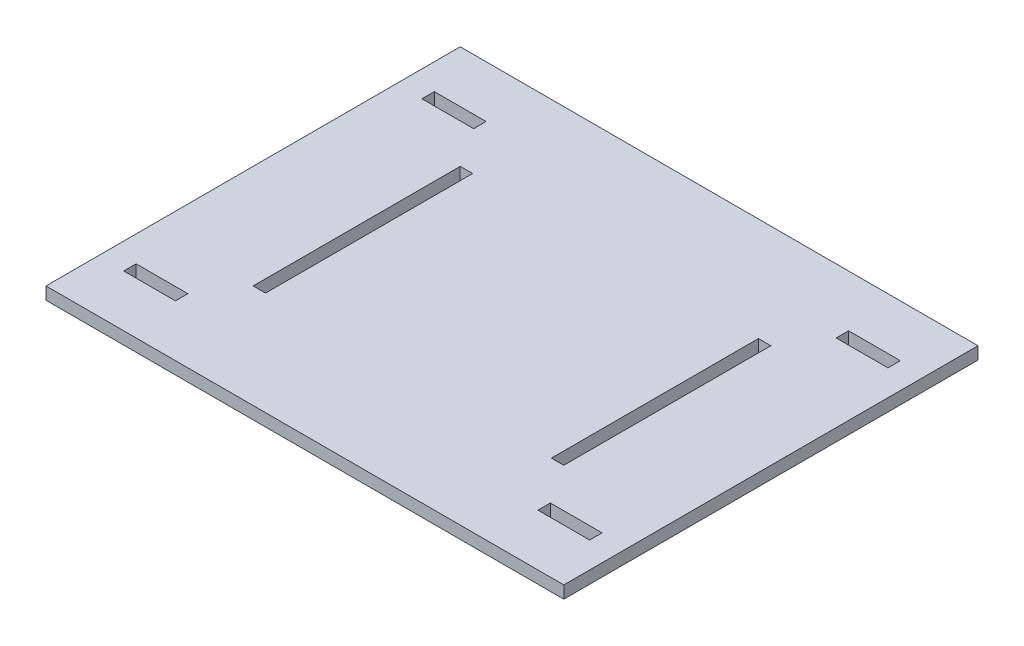
ISO-10303-21;
HEADER;
FILE_DESCRIPTION(('STEP AP214'),'2;1');
FILE_NAME('part.step','',(''),(''),'','','');
FILE_SCHEMA(('AUTOMOTIVE_DESIGN { 1 0 10303 214 1 1 1 1 }'));
ENDSEC;
DATA;
#1=APPLICATION_CONTEXT('core data for automotive mechanical design processes');
#2=APPLICATION_PROTOCOL_DEFINITION('international standard','automotive_design',2000,#1);
#3=PRODUCT_CONTEXT('',#1,'mechanical');
#4=PRODUCT('Part','Part','',(#3));
#5=PRODUCT_RELATED_PRODUCT_CATEGORY('part','',(#4));
#6=PRODUCT_DEFINITION_FORMATION('','',#4);
#7=PRODUCT_DEFINITION_CONTEXT('part definition',#1,'design');
#8=PRODUCT_DEFINITION('design','',#6,#7);
#9=PRODUCT_DEFINITION_SHAPE('','',#8);
#10=(LENGTH_UNIT() NAMED_UNIT(*) SI_UNIT(.MILLI.,.METRE.));
#11=(NAMED_UNIT(*) PLANE_ANGLE_UNIT() SI_UNIT($,.RADIAN.));
#12=(NAMED_UNIT(*) SI_UNIT($,.STERADIAN.) SOLID_ANGLE_UNIT());
#13=UNCERTAINTY_MEASURE_WITH_UNIT(LENGTH_MEASURE(1.E-05),#10,'distance_accuracy_value','');
#14=(GEOMETRIC_REPRESENTATION_CONTEXT(3) GLOBAL_UNCERTAINTY_ASSIGNED_CONTEXT((#13)) GLOBAL_UNIT_ASSIGNED_CONTEXT((#10,
#11,#12)) REPRESENTATION_CONTEXT('',''));
#15=CARTESIAN_POINT('',(0.,0.,0.));
#16=DIRECTION('',(0.,0.,1.));
#17=DIRECTION('',(1.,0.,0.));
#18=AXIS2_PLACEMENT_3D('',#15,#16,#17);
#19=CARTESIAN_POINT('',(-250.,12.,-200.));
#20=DIRECTION('',(0.,0.,-1.));
#21=DIRECTION('',(-1.,0.,0.));
#22=AXIS2_PLACEMENT_3D('',#19,#20,#21);
#23=PLANE('',#22);
#24=DIRECTION('',(1.,0.,0.));
#25=VECTOR('',#24,1.);
#26=CARTESIAN_POINT('',(-250.,0.,-200.));
#27=LINE('',#26,#25);
#28=CARTESIAN_POINT('',(-250.,0.,-200.));
#29=VERTEX_POINT('',#28);
#30=CARTESIAN_POINT('',(250.,0.,-200.));
#31=VERTEX_POINT('',#30);
#32=EDGE_CURVE('E458',#29,#31,#27,.T.);
#33=ORIENTED_EDGE('',*,*,#32,.F.);
#34=DIRECTION('',(0.,-1.,0.));
#35=VECTOR('',#34,1.);
#36=CARTESIAN_POINT('',(-250.,12.,-200.));
#37=LINE('',#36,#35);
#38=CARTESIAN_POINT('',(-250.,12.,-200.));
#39=VERTEX_POINT('',#38);
#40=EDGE_CURVE('E11',#39,#29,#37,.T.);
#41=ORIENTED_EDGE('',*,*,#40,.F.);
#42=DIRECTION('',(1.,0.,0.));
#43=VECTOR('',#42,1.);
#44=CARTESIAN_POINT('',(-250.,12.,-200.));
#45=LINE('',#44,#43);
#46=CARTESIAN_POINT('',(250.,12.,-200.));
#47=VERTEX_POINT('',#46);
#48=EDGE_CURVE('E481',#39,#47,#45,.T.);
#49=ORIENTED_EDGE('',*,*,#48,.T.);
#50=DIRECTION('',(0.,-1.,0.));
#51=VECTOR('',#50,1.);
#52=CARTESIAN_POINT('',(250.,12.,-200.));
#53=LINE('',#52,#51);
#54=EDGE_CURVE('E45',#47,#31,#53,.T.);
#55=ORIENTED_EDGE('',*,*,#54,.T.);
#56=EDGE_LOOP('',(#33,#41,#49,#55));
#57=FACE_BOUND('',#56,.T.);
#58=ADVANCED_FACE('F42',(#57),#23,.T.);
#59=CARTESIAN_POINT('',(-250.,12.,-200.));
#60=DIRECTION('',(1.,0.,0.));
#61=DIRECTION('',(0.,0.,-1.));
#62=AXIS2_PLACEMENT_3D('',#59,#60,#61);
#63=PLANE('',#62);
#64=DIRECTION('',(0.,0.,1.));
#65=VECTOR('',#64,1.);
#66=CARTESIAN_POINT('',(-250.,0.,-200.));
#67=LINE('',#66,#65);
#68=CARTESIAN_POINT('',(-250.,0.,200.));
#69=VERTEX_POINT('',#68);
#70=EDGE_CURVE('E486',#29,#69,#67,.T.);
#71=ORIENTED_EDGE('',*,*,#70,.T.);
#72=DIRECTION('',(0.,-1.,0.));
#73=VECTOR('',#72,1.);
#74=CARTESIAN_POINT('',(-250.,12.,200.));
#75=LINE('',#74,#73);
#76=CARTESIAN_POINT('',(-250.,12.,200.));
#77=VERTEX_POINT('',#76);
#78=EDGE_CURVE('E51',#77,#69,#75,.T.);
#79=ORIENTED_EDGE('',*,*,#78,.F.);
#80=DIRECTION('',(0.,0.,1.));
#81=VECTOR('',#80,1.);
#82=CARTESIAN_POINT('',(-250.,12.,-200.));
#83=LINE('',#82,#81);
#84=EDGE_CURVE('E493',#39,#77,#83,.T.);
#85=ORIENTED_EDGE('',*,*,#84,.F.);
#86=ORIENTED_EDGE('',*,*,#40,.T.);
#87=EDGE_LOOP('',(#71,#79,#85,#86));
#88=FACE_BOUND('',#87,.T.);
#89=ADVANCED_FACE('F528',(#88),#63,.F.);
#90=CARTESIAN_POINT('',(-250.,12.,200.));
#91=DIRECTION('',(0.,0.,-1.));
#92=DIRECTION('',(-1.,0.,0.));
#93=AXIS2_PLACEMENT_3D('',#90,#91,#92);
#94=PLANE('',#93);
#95=DIRECTION('',(1.,0.,0.));
#96=VECTOR('',#95,1.);
#97=CARTESIAN_POINT('',(-250.,0.,200.));
#98=LINE('',#97,#96);
#99=CARTESIAN_POINT('',(250.,0.,200.));
#100=VERTEX_POINT('',#99);
#101=EDGE_CURVE('E503',#69,#100,#98,.T.);
#102=ORIENTED_EDGE('',*,*,#101,.T.);
#103=DIRECTION('',(0.,-1.,0.));
#104=VECTOR('',#103,1.);
#105=CARTESIAN_POINT('',(250.,12.,200.));
#106=LINE('',#105,#104);
#107=CARTESIAN_POINT('',(250.,12.,200.));
#108=VERTEX_POINT('',#107);
#109=EDGE_CURVE('E511',#108,#100,#106,.T.);
#110=ORIENTED_EDGE('',*,*,#109,.F.);
#111=DIRECTION('',(1.,0.,0.));
#112=VECTOR('',#111,1.);
#113=CARTESIAN_POINT('',(-250.,12.,200.));
#114=LINE('',#113,#112);
#115=EDGE_CURVE('E490',#77,#108,#114,.T.);
#116=ORIENTED_EDGE('',*,*,#115,.F.);
#117=ORIENTED_EDGE('',*,*,#78,.T.);
#118=EDGE_LOOP('',(#102,#110,#116,#117));
#119=FACE_BOUND('',#118,.T.);
#120=ADVANCED_FACE('F532',(#119),#94,.F.);
#121=CARTESIAN_POINT('',(250.,12.,-200.));
#122=DIRECTION('',(1.,0.,0.));
#123=DIRECTION('',(0.,0.,-1.));
#124=AXIS2_PLACEMENT_3D('',#121,#122,#123);
#125=PLANE('',#124);
#126=DIRECTION('',(0.,0.,1.));
#127=VECTOR('',#126,1.);
#128=CARTESIAN_POINT('',(250.,0.,-200.));
#129=LINE('',#128,#127);
#130=EDGE_CURVE('E499',#31,#100,#129,.T.);
#131=ORIENTED_EDGE('',*,*,#130,.F.);
#132=ORIENTED_EDGE('',*,*,#54,.F.);
#133=DIRECTION('',(0.,0.,1.));
#134=VECTOR('',#133,1.);
#135=CARTESIAN_POINT('',(250.,12.,-200.));
#136=LINE('',#135,#134);
#137=EDGE_CURVE('E485',#47,#108,#136,.T.);
#138=ORIENTED_EDGE('',*,*,#137,.T.);
#139=ORIENTED_EDGE('',*,*,#109,.T.);
#140=EDGE_LOOP('',(#131,#132,#138,#139));
#141=FACE_BOUND('',#140,.T.);
#142=ADVANCED_FACE('F521',(#141),#125,.T.);
#143=CARTESIAN_POINT('',(0.,12.,0.));
#144=DIRECTION('',(0.,-1.,0.));
#145=DIRECTION('',(0.,0.,-1.));
#146=AXIS2_PLACEMENT_3D('',#143,#144,#145);
#147=PLANE('',#146);
#148=DIRECTION('',(0.,0.,-1.));
#149=VECTOR('',#148,1.);
#150=CARTESIAN_POINT('',(225.,12.,150.));
#151=LINE('',#150,#149);
#152=CARTESIAN_POINT('',(225.,12.,150.));
#153=VERTEX_POINT('',#152);
#154=CARTESIAN_POINT('',(225.,12.,138.));
#155=VERTEX_POINT('',#154);
#156=EDGE_CURVE('E249',#153,#155,#151,.T.);
#157=ORIENTED_EDGE('',*,*,#156,.F.);
#158=DIRECTION('',(1.,0.,0.));
#159=VECTOR('',#158,1.);
#160=CARTESIAN_POINT('',(225.,12.,150.));
#161=LINE('',#160,#159);
#162=CARTESIAN_POINT('',(175.,12.,150.));
#163=VERTEX_POINT('',#162);
#164=EDGE_CURVE('E241',#163,#153,#161,.T.);
#165=ORIENTED_EDGE('',*,*,#164,.F.);
#166=DIRECTION('',(0.,0.,1.));
#167=VECTOR('',#166,1.);
#168=CARTESIAN_POINT('',(175.,12.,150.));
#169=LINE('',#168,#167);
#170=CARTESIAN_POINT('',(175.,12.,138.));
#171=VERTEX_POINT('',#170);
#172=EDGE_CURVE('E229',#171,#163,#169,.T.);
#173=ORIENTED_EDGE('',*,*,#172,.F.);
#174=DIRECTION('',(-1.,0.,0.));
#175=VECTOR('',#174,1.);
#176=CARTESIAN_POINT('',(225.,12.,138.));
#177=LINE('',#176,#175);
#178=EDGE_CURVE('E59',#155,#171,#177,.T.);
#179=ORIENTED_EDGE('',*,*,#178,.F.);
#180=EDGE_LOOP('',(#157,#165,#173,#179));
#181=FACE_BOUND('',#180,.T.);
#182=DIRECTION('',(0.,0.,1.));
#183=VECTOR('',#182,1.);
#184=CARTESIAN_POINT('',(-175.,12.,150.));
#185=LINE('',#184,#183);
#186=CARTESIAN_POINT('',(-175.,12.,138.));
#187=VERTEX_POINT('',#186);
#188=CARTESIAN_POINT('',(-175.,12.,150.));
#189=VERTEX_POINT('',#188);
#190=EDGE_CURVE('E255',#187,#189,#185,.T.);
#191=ORIENTED_EDGE('',*,*,#190,.T.);
#192=DIRECTION('',(-1.,0.,0.));
#193=VECTOR('',#192,1.);
#194=CARTESIAN_POINT('',(-225.,12.,150.));
#195=LINE('',#194,#193);
#196=CARTESIAN_POINT('',(-225.,12.,150.));
#197=VERTEX_POINT('',#196);
#198=EDGE_CURVE('E296',#189,#197,#195,.T.);
#199=ORIENTED_EDGE('',*,*,#198,.T.);
#200=DIRECTION('',(0.,0.,-1.));
#201=VECTOR('',#200,1.);
#202=CARTESIAN_POINT('',(-225.,12.,150.));
#203=LINE('',#202,#201);
#204=CARTESIAN_POINT('',(-225.,12.,138.));
#205=VERTEX_POINT('',#204);
#206=EDGE_CURVE('E288',#197,#205,#203,.T.);
#207=ORIENTED_EDGE('',*,*,#206,.T.);
#208=DIRECTION('',(1.,0.,0.));
#209=VECTOR('',#208,1.);
#210=CARTESIAN_POINT('',(-225.,12.,138.));
#211=LINE('',#210,#209);
#212=EDGE_CURVE('E278',#205,#187,#211,.T.);
#213=ORIENTED_EDGE('',*,*,#212,.T.);
#214=EDGE_LOOP('',(#191,#199,#207,#213));
#215=FACE_BOUND('',#214,.T.);
#216=DIRECTION('',(0.,0.,-1.));
#217=VECTOR('',#216,1.);
#218=CARTESIAN_POINT('',(175.,12.,-150.));
#219=LINE('',#218,#217);
#220=CARTESIAN_POINT('',(175.,12.,-138.));
#221=VERTEX_POINT('',#220);
#222=CARTESIAN_POINT('',(175.,12.,-150.));
#223=VERTEX_POINT('',#222);
#224=EDGE_CURVE('E304',#221,#223,#219,.T.);
#225=ORIENTED_EDGE('',*,*,#224,.T.);
#226=DIRECTION('',(1.,0.,0.));
#227=VECTOR('',#226,1.);
#228=CARTESIAN_POINT('',(225.,12.,-150.));
#229=LINE('',#228,#227);
#230=CARTESIAN_POINT('',(225.,12.,-150.));
#231=VERTEX_POINT('',#230);
#232=EDGE_CURVE('E340',#223,#231,#229,.T.);
#233=ORIENTED_EDGE('',*,*,#232,.T.);
#234=DIRECTION('',(0.,0.,1.));
#235=VECTOR('',#234,1.);
#236=CARTESIAN_POINT('',(225.,12.,-150.));
#237=LINE('',#236,#235);
#238=CARTESIAN_POINT('',(225.,12.,-138.));
#239=VERTEX_POINT('',#238);
#240=EDGE_CURVE('E332',#231,#239,#237,.T.);
#241=ORIENTED_EDGE('',*,*,#240,.T.);
#242=DIRECTION('',(-1.,0.,0.));
#243=VECTOR('',#242,1.);
#244=CARTESIAN_POINT('',(225.,12.,-138.));
#245=LINE('',#244,#243);
#246=EDGE_CURVE('E322',#239,#221,#245,.T.);
#247=ORIENTED_EDGE('',*,*,#246,.T.);
#248=EDGE_LOOP('',(#225,#233,#241,#247));
#249=FACE_BOUND('',#248,.T.);
#250=DIRECTION('',(0.,0.,1.));
#251=VECTOR('',#250,1.);
#252=CARTESIAN_POINT('',(-225.,12.,-150.));
#253=LINE('',#252,#251);
#254=CARTESIAN_POINT('',(-225.,12.,-150.));
#255=VERTEX_POINT('',#254);
#256=CARTESIAN_POINT('',(-225.,12.,-138.));
#257=VERTEX_POINT('',#256);
#258=EDGE_CURVE('E353',#255,#257,#253,.T.);
#259=ORIENTED_EDGE('',*,*,#258,.F.);
#260=DIRECTION('',(-1.,0.,0.));
#261=VECTOR('',#260,1.);
#262=CARTESIAN_POINT('',(-225.,12.,-150.));
#263=LINE('',#262,#261);
#264=CARTESIAN_POINT('',(-175.,12.,-150.));
#265=VERTEX_POINT('',#264);
#266=EDGE_CURVE('E357',#265,#255,#263,.T.);
#267=ORIENTED_EDGE('',*,*,#266,.F.);
#268=DIRECTION('',(0.,0.,-1.));
#269=VECTOR('',#268,1.);
#270=CARTESIAN_POINT('',(-175.,12.,-150.));
#271=LINE('',#270,#269);
#272=CARTESIAN_POINT('',(-175.,12.,-138.));
#273=VERTEX_POINT('',#272);
#274=EDGE_CURVE('E348',#273,#265,#271,.T.);
#275=ORIENTED_EDGE('',*,*,#274,.F.);
#276=DIRECTION('',(1.,0.,0.));
#277=VECTOR('',#276,1.);
#278=CARTESIAN_POINT('',(-225.,12.,-138.));
#279=LINE('',#278,#277);
#280=EDGE_CURVE('E349',#257,#273,#279,.T.);
#281=ORIENTED_EDGE('',*,*,#280,.F.);
#282=EDGE_LOOP('',(#259,#267,#275,#281));
#283=FACE_BOUND('',#282,.T.);
#284=DIRECTION('',(-1.,0.,0.));
#285=VECTOR('',#284,1.);
#286=CARTESIAN_POINT('',(150.,12.,-99.9999999999998));
#287=LINE('',#286,#285);
#288=CARTESIAN_POINT('',(150.,12.,-99.9999999999998));
#289=VERTEX_POINT('',#288);
#290=CARTESIAN_POINT('',(138.,12.,-99.9999999999998));
#291=VERTEX_POINT('',#290);
#292=EDGE_CURVE('E396',#289,#291,#287,.T.);
#293=ORIENTED_EDGE('',*,*,#292,.F.);
#294=DIRECTION('',(0.,0.,1.));
#295=VECTOR('',#294,1.);
#296=CARTESIAN_POINT('',(150.,12.,-99.9999999999998));
#297=LINE('',#296,#295);
#298=CARTESIAN_POINT('',(150.,12.,100.));
#299=VERTEX_POINT('',#298);
#300=EDGE_CURVE('E429',#289,#299,#297,.T.);
#301=ORIENTED_EDGE('',*,*,#300,.T.);
#302=DIRECTION('',(-1.,0.,0.));
#303=VECTOR('',#302,1.);
#304=CARTESIAN_POINT('',(150.,12.,100.));
#305=LINE('',#304,#303);
#306=CARTESIAN_POINT('',(138.,12.,100.));
#307=VERTEX_POINT('',#306);
#308=EDGE_CURVE('E421',#299,#307,#305,.T.);
#309=ORIENTED_EDGE('',*,*,#308,.T.);
#310=DIRECTION('',(0.,0.,1.));
#311=VECTOR('',#310,1.);
#312=CARTESIAN_POINT('',(138.,12.,-99.9999999999998));
#313=LINE('',#312,#311);
#314=EDGE_CURVE('E414',#291,#307,#313,.T.);
#315=ORIENTED_EDGE('',*,*,#314,.F.);
#316=EDGE_LOOP('',(#293,#301,#309,#315));
#317=FACE_BOUND('',#316,.T.);
#318=DIRECTION('',(1.,0.,0.));
#319=VECTOR('',#318,1.);
#320=CARTESIAN_POINT('',(-150.,12.,100.));
#321=LINE('',#320,#319);
#322=CARTESIAN_POINT('',(-150.,12.,100.));
#323=VERTEX_POINT('',#322);
#324=CARTESIAN_POINT('',(-138.,12.,100.));
#325=VERTEX_POINT('',#324);
#326=EDGE_CURVE('E442',#323,#325,#321,.T.);
#327=ORIENTED_EDGE('',*,*,#326,.F.);
#328=DIRECTION('',(0.,0.,1.));
#329=VECTOR('',#328,1.);
#330=CARTESIAN_POINT('',(-150.,12.,-99.9999999999998));
#331=LINE('',#330,#329);
#332=CARTESIAN_POINT('',(-150.,12.,-99.9999999999998));
#333=VERTEX_POINT('',#332);
#334=EDGE_CURVE('E438',#333,#323,#331,.T.);
#335=ORIENTED_EDGE('',*,*,#334,.F.);
#336=DIRECTION('',(1.,0.,0.));
#337=VECTOR('',#336,1.);
#338=CARTESIAN_POINT('',(-150.,12.,-99.9999999999998));
#339=LINE('',#338,#337);
#340=CARTESIAN_POINT('',(-138.,12.,-99.9999999999998));
#341=VERTEX_POINT('',#340);
#342=EDGE_CURVE('E454',#333,#341,#339,.T.);
#343=ORIENTED_EDGE('',*,*,#342,.T.);
#344=DIRECTION('',(0.,0.,1.));
#345=VECTOR('',#344,1.);
#346=CARTESIAN_POINT('',(-138.,12.,-99.9999999999998));
#347=LINE('',#346,#345);
#348=EDGE_CURVE('E448',#341,#325,#347,.T.);
#349=ORIENTED_EDGE('',*,*,#348,.T.);
#350=EDGE_LOOP('',(#327,#335,#343,#349));
#351=FACE_BOUND('',#350,.T.);
#352=ORIENTED_EDGE('',*,*,#48,.F.);
#353=ORIENTED_EDGE('',*,*,#84,.T.);
#354=ORIENTED_EDGE('',*,*,#115,.T.);
#355=ORIENTED_EDGE('',*,*,#137,.F.);
#356=EDGE_LOOP('',(#352,#353,#354,#355));
#357=FACE_BOUND('',#356,.T.);
#358=ADVANCED_FACE('F246',(#181,#215,#249,#283,#317,#351,#357),#147,.F.);
#359=CARTESIAN_POINT('',(0.,0.,0.));
#360=DIRECTION('',(0.,-1.,0.));
#361=DIRECTION('',(0.,0.,-1.));
#362=AXIS2_PLACEMENT_3D('',#359,#360,#361);
#363=PLANE('',#362);
#364=DIRECTION('',(1.,0.,0.));
#365=VECTOR('',#364,1.);
#366=CARTESIAN_POINT('',(225.,0.,150.));
#367=LINE('',#366,#365);
#368=CARTESIAN_POINT('',(175.,0.,150.));
#369=VERTEX_POINT('',#368);
#370=CARTESIAN_POINT('',(225.,0.,150.));
#371=VERTEX_POINT('',#370);
#372=EDGE_CURVE('E67',#369,#371,#367,.T.);
#373=ORIENTED_EDGE('',*,*,#372,.T.);
#374=DIRECTION('',(0.,0.,-1.));
#375=VECTOR('',#374,1.);
#376=CARTESIAN_POINT('',(225.,0.,150.));
#377=LINE('',#376,#375);
#378=CARTESIAN_POINT('',(225.,0.,138.));
#379=VERTEX_POINT('',#378);
#380=EDGE_CURVE('E251',#371,#379,#377,.T.);
#381=ORIENTED_EDGE('',*,*,#380,.T.);
#382=DIRECTION('',(-1.,0.,0.));
#383=VECTOR('',#382,1.);
#384=CARTESIAN_POINT('',(225.,0.,138.));
#385=LINE('',#384,#383);
#386=CARTESIAN_POINT('',(175.,0.,138.));
#387=VERTEX_POINT('',#386);
#388=EDGE_CURVE('E878',#379,#387,#385,.T.);
#389=ORIENTED_EDGE('',*,*,#388,.T.);
#390=DIRECTION('',(0.,0.,1.));
#391=VECTOR('',#390,1.);
#392=CARTESIAN_POINT('',(175.,0.,150.));
#393=LINE('',#392,#391);
#394=EDGE_CURVE('E237',#387,#369,#393,.T.);
#395=ORIENTED_EDGE('',*,*,#394,.T.);
#396=EDGE_LOOP('',(#373,#381,#389,#395));
#397=FACE_BOUND('',#396,.T.);
#398=DIRECTION('',(-1.,0.,0.));
#399=VECTOR('',#398,1.);
#400=CARTESIAN_POINT('',(-225.,0.,150.));
#401=LINE('',#400,#399);
#402=CARTESIAN_POINT('',(-175.,0.,150.));
#403=VERTEX_POINT('',#402);
#404=CARTESIAN_POINT('',(-225.,0.,150.));
#405=VERTEX_POINT('',#404);
#406=EDGE_CURVE('E300',#403,#405,#401,.T.);
#407=ORIENTED_EDGE('',*,*,#406,.F.);
#408=DIRECTION('',(0.,0.,1.));
#409=VECTOR('',#408,1.);
#410=CARTESIAN_POINT('',(-175.,0.,150.));
#411=LINE('',#410,#409);
#412=CARTESIAN_POINT('',(-175.,0.,138.));
#413=VERTEX_POINT('',#412);
#414=EDGE_CURVE('E264',#413,#403,#411,.T.);
#415=ORIENTED_EDGE('',*,*,#414,.F.);
#416=DIRECTION('',(1.,0.,0.));
#417=VECTOR('',#416,1.);
#418=CARTESIAN_POINT('',(-225.,0.,138.));
#419=LINE('',#418,#417);
#420=CARTESIAN_POINT('',(-225.,0.,138.));
#421=VERTEX_POINT('',#420);
#422=EDGE_CURVE('E282',#421,#413,#419,.T.);
#423=ORIENTED_EDGE('',*,*,#422,.F.);
#424=DIRECTION('',(0.,0.,-1.));
#425=VECTOR('',#424,1.);
#426=CARTESIAN_POINT('',(-225.,0.,150.));
#427=LINE('',#426,#425);
#428=EDGE_CURVE('E292',#405,#421,#427,.T.);
#429=ORIENTED_EDGE('',*,*,#428,.F.);
#430=EDGE_LOOP('',(#407,#415,#423,#429));
#431=FACE_BOUND('',#430,.T.);
#432=DIRECTION('',(1.,0.,0.));
#433=VECTOR('',#432,1.);
#434=CARTESIAN_POINT('',(225.,0.,-150.));
#435=LINE('',#434,#433);
#436=CARTESIAN_POINT('',(175.,0.,-150.));
#437=VERTEX_POINT('',#436);
#438=CARTESIAN_POINT('',(225.,0.,-150.));
#439=VERTEX_POINT('',#438);
#440=EDGE_CURVE('E344',#437,#439,#435,.T.);
#441=ORIENTED_EDGE('',*,*,#440,.F.);
#442=DIRECTION('',(0.,0.,-1.));
#443=VECTOR('',#442,1.);
#444=CARTESIAN_POINT('',(175.,0.,-150.));
#445=LINE('',#444,#443);
#446=CARTESIAN_POINT('',(175.,0.,-138.));
#447=VERTEX_POINT('',#446);
#448=EDGE_CURVE('E308',#447,#437,#445,.T.);
#449=ORIENTED_EDGE('',*,*,#448,.F.);
#450=DIRECTION('',(-1.,0.,0.));
#451=VECTOR('',#450,1.);
#452=CARTESIAN_POINT('',(225.,0.,-138.));
#453=LINE('',#452,#451);
#454=CARTESIAN_POINT('',(225.,0.,-138.));
#455=VERTEX_POINT('',#454);
#456=EDGE_CURVE('E326',#455,#447,#453,.T.);
#457=ORIENTED_EDGE('',*,*,#456,.F.);
#458=DIRECTION('',(0.,0.,1.));
#459=VECTOR('',#458,1.);
#460=CARTESIAN_POINT('',(225.,0.,-150.));
#461=LINE('',#460,#459);
#462=EDGE_CURVE('E336',#439,#455,#461,.T.);
#463=ORIENTED_EDGE('',*,*,#462,.F.);
#464=EDGE_LOOP('',(#441,#449,#457,#463));
#465=FACE_BOUND('',#464,.T.);
#466=DIRECTION('',(-1.,0.,0.));
#467=VECTOR('',#466,1.);
#468=CARTESIAN_POINT('',(-225.,0.,-150.));
#469=LINE('',#468,#467);
#470=CARTESIAN_POINT('',(-175.,0.,-150.));
#471=VERTEX_POINT('',#470);
#472=CARTESIAN_POINT('',(-225.,0.,-150.));
#473=VERTEX_POINT('',#472);
#474=EDGE_CURVE('E352',#471,#473,#469,.T.);
#475=ORIENTED_EDGE('',*,*,#474,.T.);
#476=DIRECTION('',(0.,0.,1.));
#477=VECTOR('',#476,1.);
#478=CARTESIAN_POINT('',(-225.,0.,-150.));
#479=LINE('',#478,#477);
#480=CARTESIAN_POINT('',(-225.,0.,-138.));
#481=VERTEX_POINT('',#480);
#482=EDGE_CURVE('E379',#473,#481,#479,.T.);
#483=ORIENTED_EDGE('',*,*,#482,.T.);
#484=DIRECTION('',(1.,0.,0.));
#485=VECTOR('',#484,1.);
#486=CARTESIAN_POINT('',(-225.,0.,-138.));
#487=LINE('',#486,#485);
#488=CARTESIAN_POINT('',(-175.,0.,-138.));
#489=VERTEX_POINT('',#488);
#490=EDGE_CURVE('E374',#481,#489,#487,.T.);
#491=ORIENTED_EDGE('',*,*,#490,.T.);
#492=DIRECTION('',(0.,0.,-1.));
#493=VECTOR('',#492,1.);
#494=CARTESIAN_POINT('',(-175.,0.,-150.));
#495=LINE('',#494,#493);
#496=EDGE_CURVE('E368',#489,#471,#495,.T.);
#497=ORIENTED_EDGE('',*,*,#496,.T.);
#498=EDGE_LOOP('',(#475,#483,#491,#497));
#499=FACE_BOUND('',#498,.T.);
#500=DIRECTION('',(0.,0.,1.));
#501=VECTOR('',#500,1.);
#502=CARTESIAN_POINT('',(150.,0.,-99.9999999999998));
#503=LINE('',#502,#501);
#504=CARTESIAN_POINT('',(150.,0.,-99.9999999999998));
#505=VERTEX_POINT('',#504);
#506=CARTESIAN_POINT('',(150.,0.,100.));
#507=VERTEX_POINT('',#506);
#508=EDGE_CURVE('E433',#505,#507,#503,.T.);
#509=ORIENTED_EDGE('',*,*,#508,.F.);
#510=DIRECTION('',(-1.,0.,0.));
#511=VECTOR('',#510,1.);
#512=CARTESIAN_POINT('',(150.,0.,-99.9999999999998));
#513=LINE('',#512,#511);
#514=CARTESIAN_POINT('',(138.,0.,-99.9999999999998));
#515=VERTEX_POINT('',#514);
#516=EDGE_CURVE('E392',#505,#515,#513,.T.);
#517=ORIENTED_EDGE('',*,*,#516,.T.);
#518=DIRECTION('',(0.,0.,1.));
#519=VECTOR('',#518,1.);
#520=CARTESIAN_POINT('',(138.,0.,-99.9999999999998));
#521=LINE('',#520,#519);
#522=CARTESIAN_POINT('',(138.,0.,100.));
#523=VERTEX_POINT('',#522);
#524=EDGE_CURVE('E407',#515,#523,#521,.T.);
#525=ORIENTED_EDGE('',*,*,#524,.T.);
#526=DIRECTION('',(-1.,0.,0.));
#527=VECTOR('',#526,1.);
#528=CARTESIAN_POINT('',(150.,0.,100.));
#529=LINE('',#528,#527);
#530=EDGE_CURVE('E425',#507,#523,#529,.T.);
#531=ORIENTED_EDGE('',*,*,#530,.F.);
#532=EDGE_LOOP('',(#509,#517,#525,#531));
#533=FACE_BOUND('',#532,.T.);
#534=DIRECTION('',(0.,0.,1.));
#535=VECTOR('',#534,1.);
#536=CARTESIAN_POINT('',(-150.,0.,-99.9999999999998));
#537=LINE('',#536,#535);
#538=CARTESIAN_POINT('',(-150.,0.,-99.9999999999998));
#539=VERTEX_POINT('',#538);
#540=CARTESIAN_POINT('',(-150.,0.,100.));
#541=VERTEX_POINT('',#540);
#542=EDGE_CURVE('E447',#539,#541,#537,.T.);
#543=ORIENTED_EDGE('',*,*,#542,.T.);
#544=DIRECTION('',(1.,0.,0.));
#545=VECTOR('',#544,1.);
#546=CARTESIAN_POINT('',(-150.,0.,100.));
#547=LINE('',#546,#545);
#548=CARTESIAN_POINT('',(-138.,0.,100.));
#549=VERTEX_POINT('',#548);
#550=EDGE_CURVE('E467',#541,#549,#547,.T.);
#551=ORIENTED_EDGE('',*,*,#550,.T.);
#552=DIRECTION('',(0.,0.,1.));
#553=VECTOR('',#552,1.);
#554=CARTESIAN_POINT('',(-138.,0.,-99.9999999999998));
#555=LINE('',#554,#553);
#556=CARTESIAN_POINT('',(-138.,0.,-99.9999999999998));
#557=VERTEX_POINT('',#556);
#558=EDGE_CURVE('E443',#557,#549,#555,.T.);
#559=ORIENTED_EDGE('',*,*,#558,.F.);
#560=DIRECTION('',(1.,0.,0.));
#561=VECTOR('',#560,1.);
#562=CARTESIAN_POINT('',(-150.,0.,-99.9999999999998));
#563=LINE('',#562,#561);
#564=EDGE_CURVE('E437',#539,#557,#563,.T.);
#565=ORIENTED_EDGE('',*,*,#564,.F.);
#566=EDGE_LOOP('',(#543,#551,#559,#565));
#567=FACE_BOUND('',#566,.T.);
#568=ORIENTED_EDGE('',*,*,#32,.T.);
#569=ORIENTED_EDGE('',*,*,#130,.T.);
#570=ORIENTED_EDGE('',*,*,#101,.F.);
#571=ORIENTED_EDGE('',*,*,#70,.F.);
#572=EDGE_LOOP('',(#568,#569,#570,#571));
#573=FACE_BOUND('',#572,.T.);
#574=ADVANCED_FACE('F525',(#397,#431,#465,#499,#533,#567,#573),#363,.T.);
#575=CARTESIAN_POINT('',(-150.,-200.359676581891,-99.9999999999998));
#576=DIRECTION('',(-1.,0.,0.));
#577=DIRECTION('',(0.,0.,1.));
#578=AXIS2_PLACEMENT_3D('',#575,#576,#577);
#579=PLANE('',#578);
#580=DIRECTION('',(0.,1.,0.));
#581=VECTOR('',#580,1.);
#582=CARTESIAN_POINT('',(-150.,-200.359676581891,-99.9999999999998));
#583=LINE('',#582,#581);
#584=EDGE_CURVE('E452',#539,#333,#583,.T.);
#585=ORIENTED_EDGE('',*,*,#584,.T.);
#586=ORIENTED_EDGE('',*,*,#334,.T.);
#587=DIRECTION('',(0.,1.,0.));
#588=VECTOR('',#587,1.);
#589=CARTESIAN_POINT('',(-150.,-200.359676581891,100.));
#590=LINE('',#589,#588);
#591=EDGE_CURVE('E462',#541,#323,#590,.T.);
#592=ORIENTED_EDGE('',*,*,#591,.F.);
#593=ORIENTED_EDGE('',*,*,#542,.F.);
#594=EDGE_LOOP('',(#585,#586,#592,#593));
#595=FACE_BOUND('',#594,.T.);
#596=ADVANCED_FACE('F540',(#595),#579,.F.);
#597=CARTESIAN_POINT('',(-150.,-200.359676581891,100.));
#598=DIRECTION('',(0.,0.,1.));
#599=DIRECTION('',(1.,0.,0.));
#600=AXIS2_PLACEMENT_3D('',#597,#598,#599);
#601=PLANE('',#600);
#602=ORIENTED_EDGE('',*,*,#591,.T.);
#603=ORIENTED_EDGE('',*,*,#326,.T.);
#604=DIRECTION('',(0.,1.,0.));
#605=VECTOR('',#604,1.);
#606=CARTESIAN_POINT('',(-138.,-200.359676581891,100.));
#607=LINE('',#606,#605);
#608=EDGE_CURVE('E471',#549,#325,#607,.T.);
#609=ORIENTED_EDGE('',*,*,#608,.F.);
#610=ORIENTED_EDGE('',*,*,#550,.F.);
#611=EDGE_LOOP('',(#602,#603,#609,#610));
#612=FACE_BOUND('',#611,.T.);
#613=ADVANCED_FACE('F570',(#612),#601,.F.);
#614=CARTESIAN_POINT('',(-138.,-200.359676581891,-99.9999999999998));
#615=DIRECTION('',(-1.,0.,0.));
#616=DIRECTION('',(0.,0.,1.));
#617=AXIS2_PLACEMENT_3D('',#614,#615,#616);
#618=PLANE('',#617);
#619=ORIENTED_EDGE('',*,*,#558,.T.);
#620=ORIENTED_EDGE('',*,*,#608,.T.);
#621=ORIENTED_EDGE('',*,*,#348,.F.);
#622=DIRECTION('',(0.,1.,0.));
#623=VECTOR('',#622,1.);
#624=CARTESIAN_POINT('',(-138.,-200.359676581891,-99.9999999999998));
#625=LINE('',#624,#623);
#626=EDGE_CURVE('E453',#557,#341,#625,.T.);
#627=ORIENTED_EDGE('',*,*,#626,.F.);
#628=EDGE_LOOP('',(#619,#620,#621,#627));
#629=FACE_BOUND('',#628,.T.);
#630=ADVANCED_FACE('F581',(#629),#618,.T.);
#631=CARTESIAN_POINT('',(-150.,-200.359676581891,-99.9999999999998));
#632=DIRECTION('',(0.,0.,1.));
#633=DIRECTION('',(1.,0.,0.));
#634=AXIS2_PLACEMENT_3D('',#631,#632,#633);
#635=PLANE('',#634);
#636=ORIENTED_EDGE('',*,*,#564,.T.);
#637=ORIENTED_EDGE('',*,*,#626,.T.);
#638=ORIENTED_EDGE('',*,*,#342,.F.);
#639=ORIENTED_EDGE('',*,*,#584,.F.);
#640=EDGE_LOOP('',(#636,#637,#638,#639));
#641=FACE_BOUND('',#640,.T.);
#642=ADVANCED_FACE('F592',(#641),#635,.T.);
#643=CARTESIAN_POINT('',(150.,-200.359676581891,-99.9999999999998));
#644=DIRECTION('',(1.,0.,0.));
#645=DIRECTION('',(0.,0.,1.));
#646=AXIS2_PLACEMENT_3D('',#643,#644,#645);
#647=PLANE('',#646);
#648=DIRECTION('',(0.,1.,0.));
#649=VECTOR('',#648,1.);
#650=CARTESIAN_POINT('',(150.,-200.359676581891,-99.9999999999998));
#651=LINE('',#650,#649);
#652=EDGE_CURVE('E403',#505,#289,#651,.T.);
#653=ORIENTED_EDGE('',*,*,#652,.F.);
#654=ORIENTED_EDGE('',*,*,#508,.T.);
#655=DIRECTION('',(0.,1.,0.));
#656=VECTOR('',#655,1.);
#657=CARTESIAN_POINT('',(150.,-200.359676581891,100.));
#658=LINE('',#657,#656);
#659=EDGE_CURVE('E418',#507,#299,#658,.T.);
#660=ORIENTED_EDGE('',*,*,#659,.T.);
#661=ORIENTED_EDGE('',*,*,#300,.F.);
#662=EDGE_LOOP('',(#653,#654,#660,#661));
#663=FACE_BOUND('',#662,.T.);
#664=ADVANCED_FACE('F603',(#663),#647,.F.);
#665=CARTESIAN_POINT('',(150.,-200.359676581891,100.));
#666=DIRECTION('',(0.,0.,1.));
#667=DIRECTION('',(-1.,0.,0.));
#668=AXIS2_PLACEMENT_3D('',#665,#666,#667);
#669=PLANE('',#668);
#670=ORIENTED_EDGE('',*,*,#659,.F.);
#671=ORIENTED_EDGE('',*,*,#530,.T.);
#672=DIRECTION('',(0.,1.,0.));
#673=VECTOR('',#672,1.);
#674=CARTESIAN_POINT('',(138.,-200.359676581891,100.));
#675=LINE('',#674,#673);
#676=EDGE_CURVE('E411',#523,#307,#675,.T.);
#677=ORIENTED_EDGE('',*,*,#676,.T.);
#678=ORIENTED_EDGE('',*,*,#308,.F.);
#679=EDGE_LOOP('',(#670,#671,#677,#678));
#680=FACE_BOUND('',#679,.T.);
#681=ADVANCED_FACE('F614',(#680),#669,.F.);
#682=CARTESIAN_POINT('',(138.,-200.359676581891,-99.9999999999998));
#683=DIRECTION('',(1.,0.,0.));
#684=DIRECTION('',(0.,0.,1.));
#685=AXIS2_PLACEMENT_3D('',#682,#683,#684);
#686=PLANE('',#685);
#687=ORIENTED_EDGE('',*,*,#524,.F.);
#688=DIRECTION('',(0.,1.,0.));
#689=VECTOR('',#688,1.);
#690=CARTESIAN_POINT('',(138.,-200.359676581891,-99.9999999999998));
#691=LINE('',#690,#689);
#692=EDGE_CURVE('E400',#515,#291,#691,.T.);
#693=ORIENTED_EDGE('',*,*,#692,.T.);
#694=ORIENTED_EDGE('',*,*,#314,.T.);
#695=ORIENTED_EDGE('',*,*,#676,.F.);
#696=EDGE_LOOP('',(#687,#693,#694,#695));
#697=FACE_BOUND('',#696,.T.);
#698=ADVANCED_FACE('F625',(#697),#686,.T.);
#699=CARTESIAN_POINT('',(150.,-200.359676581891,-99.9999999999998));
#700=DIRECTION('',(0.,0.,1.));
#701=DIRECTION('',(-1.,0.,0.));
#702=AXIS2_PLACEMENT_3D('',#699,#700,#701);
#703=PLANE('',#702);
#704=ORIENTED_EDGE('',*,*,#516,.F.);
#705=ORIENTED_EDGE('',*,*,#652,.T.);
#706=ORIENTED_EDGE('',*,*,#292,.T.);
#707=ORIENTED_EDGE('',*,*,#692,.F.);
#708=EDGE_LOOP('',(#704,#705,#706,#707));
#709=FACE_BOUND('',#708,.T.);
#710=ADVANCED_FACE('F636',(#709),#703,.T.);
#711=CARTESIAN_POINT('',(-225.,-51.4198405287298,-150.));
#712=DIRECTION('',(0.,0.,-1.));
#713=DIRECTION('',(-1.,0.,0.));
#714=AXIS2_PLACEMENT_3D('',#711,#712,#713);
#715=PLANE('',#714);
#716=DIRECTION('',(0.,1.,0.));
#717=VECTOR('',#716,1.);
#718=CARTESIAN_POINT('',(-175.,-51.4198405287298,-150.));
#719=LINE('',#718,#717);
#720=EDGE_CURVE('E372',#471,#265,#719,.T.);
#721=ORIENTED_EDGE('',*,*,#720,.T.);
#722=ORIENTED_EDGE('',*,*,#266,.T.);
#723=DIRECTION('',(0.,1.,0.));
#724=VECTOR('',#723,1.);
#725=CARTESIAN_POINT('',(-225.,-51.4198405287298,-150.));
#726=LINE('',#725,#724);
#727=EDGE_CURVE('E367',#473,#255,#726,.T.);
#728=ORIENTED_EDGE('',*,*,#727,.F.);
#729=ORIENTED_EDGE('',*,*,#474,.F.);
#730=EDGE_LOOP('',(#721,#722,#728,#729));
#731=FACE_BOUND('',#730,.T.);
#732=ADVANCED_FACE('F647',(#731),#715,.F.);
#733=CARTESIAN_POINT('',(-225.,-51.4198405287298,-150.));
#734=DIRECTION('',(-1.,0.,0.));
#735=DIRECTION('',(0.,0.,1.));
#736=AXIS2_PLACEMENT_3D('',#733,#734,#735);
#737=PLANE('',#736);
#738=ORIENTED_EDGE('',*,*,#727,.T.);
#739=ORIENTED_EDGE('',*,*,#258,.T.);
#740=DIRECTION('',(0.,1.,0.));
#741=VECTOR('',#740,1.);
#742=CARTESIAN_POINT('',(-225.,-51.4198405287298,-138.));
#743=LINE('',#742,#741);
#744=EDGE_CURVE('E378',#481,#257,#743,.T.);
#745=ORIENTED_EDGE('',*,*,#744,.F.);
#746=ORIENTED_EDGE('',*,*,#482,.F.);
#747=EDGE_LOOP('',(#738,#739,#745,#746));
#748=FACE_BOUND('',#747,.T.);
#749=ADVANCED_FACE('F658',(#748),#737,.F.);
#750=CARTESIAN_POINT('',(-225.,-51.4198405287298,-138.));
#751=DIRECTION('',(0.,0.,1.));
#752=DIRECTION('',(1.,0.,0.));
#753=AXIS2_PLACEMENT_3D('',#750,#751,#752);
#754=PLANE('',#753);
#755=ORIENTED_EDGE('',*,*,#744,.T.);
#756=ORIENTED_EDGE('',*,*,#280,.T.);
#757=DIRECTION('',(0.,1.,0.));
#758=VECTOR('',#757,1.);
#759=CARTESIAN_POINT('',(-175.,-51.4198405287298,-138.));
#760=LINE('',#759,#758);
#761=EDGE_CURVE('E373',#489,#273,#760,.T.);
#762=ORIENTED_EDGE('',*,*,#761,.F.);
#763=ORIENTED_EDGE('',*,*,#490,.F.);
#764=EDGE_LOOP('',(#755,#756,#762,#763));
#765=FACE_BOUND('',#764,.T.);
#766=ADVANCED_FACE('F669',(#765),#754,.F.);
#767=CARTESIAN_POINT('',(-175.,-51.4198405287298,-150.));
#768=DIRECTION('',(1.,0.,0.));
#769=DIRECTION('',(0.,0.,-1.));
#770=AXIS2_PLACEMENT_3D('',#767,#768,#769);
#771=PLANE('',#770);
#772=ORIENTED_EDGE('',*,*,#761,.T.);
#773=ORIENTED_EDGE('',*,*,#274,.T.);
#774=ORIENTED_EDGE('',*,*,#720,.F.);
#775=ORIENTED_EDGE('',*,*,#496,.F.);
#776=EDGE_LOOP('',(#772,#773,#774,#775));
#777=FACE_BOUND('',#776,.T.);
#778=ADVANCED_FACE('F680',(#777),#771,.F.);
#779=CARTESIAN_POINT('',(225.,-51.4198405287298,-150.));
#780=DIRECTION('',(0.,0.,-1.));
#781=DIRECTION('',(1.,0.,0.));
#782=AXIS2_PLACEMENT_3D('',#779,#780,#781);
#783=PLANE('',#782);
#784=DIRECTION('',(0.,1.,0.));
#785=VECTOR('',#784,1.);
#786=CARTESIAN_POINT('',(175.,-51.4198405287298,-150.));
#787=LINE('',#786,#785);
#788=EDGE_CURVE('E315',#437,#223,#787,.T.);
#789=ORIENTED_EDGE('',*,*,#788,.F.);
#790=ORIENTED_EDGE('',*,*,#440,.T.);
#791=DIRECTION('',(0.,1.,0.));
#792=VECTOR('',#791,1.);
#793=CARTESIAN_POINT('',(225.,-51.4198405287298,-150.));
#794=LINE('',#793,#792);
#795=EDGE_CURVE('E329',#439,#231,#794,.T.);
#796=ORIENTED_EDGE('',*,*,#795,.T.);
#797=ORIENTED_EDGE('',*,*,#232,.F.);
#798=EDGE_LOOP('',(#789,#790,#796,#797));
#799=FACE_BOUND('',#798,.T.);
#800=ADVANCED_FACE('F690',(#799),#783,.F.);
#801=CARTESIAN_POINT('',(225.,-51.4198405287298,-150.));
#802=DIRECTION('',(1.,0.,0.));
#803=DIRECTION('',(0.,0.,1.));
#804=AXIS2_PLACEMENT_3D('',#801,#802,#803);
#805=PLANE('',#804);
#806=ORIENTED_EDGE('',*,*,#795,.F.);
#807=ORIENTED_EDGE('',*,*,#462,.T.);
#808=DIRECTION('',(0.,1.,0.));
#809=VECTOR('',#808,1.);
#810=CARTESIAN_POINT('',(225.,-51.4198405287298,-138.));
#811=LINE('',#810,#809);
#812=EDGE_CURVE('E319',#455,#239,#811,.T.);
#813=ORIENTED_EDGE('',*,*,#812,.T.);
#814=ORIENTED_EDGE('',*,*,#240,.F.);
#815=EDGE_LOOP('',(#806,#807,#813,#814));
#816=FACE_BOUND('',#815,.T.);
#817=ADVANCED_FACE('F712',(#816),#805,.F.);
#818=CARTESIAN_POINT('',(225.,-51.4198405287298,-138.));
#819=DIRECTION('',(0.,0.,1.));
#820=DIRECTION('',(-1.,0.,0.));
#821=AXIS2_PLACEMENT_3D('',#818,#819,#820);
#822=PLANE('',#821);
#823=ORIENTED_EDGE('',*,*,#812,.F.);
#824=ORIENTED_EDGE('',*,*,#456,.T.);
#825=DIRECTION('',(0.,1.,0.));
#826=VECTOR('',#825,1.);
#827=CARTESIAN_POINT('',(175.,-51.4198405287298,-138.));
#828=LINE('',#827,#826);
#829=EDGE_CURVE('E312',#447,#221,#828,.T.);
#830=ORIENTED_EDGE('',*,*,#829,.T.);
#831=ORIENTED_EDGE('',*,*,#246,.F.);
#832=EDGE_LOOP('',(#823,#824,#830,#831));
#833=FACE_BOUND('',#832,.T.);
#834=ADVANCED_FACE('F723',(#833),#822,.F.);
#835=CARTESIAN_POINT('',(175.,-51.4198405287298,-150.));
#836=DIRECTION('',(-1.,0.,0.));
#837=DIRECTION('',(0.,0.,-1.));
#838=AXIS2_PLACEMENT_3D('',#835,#836,#837);
#839=PLANE('',#838);
#840=ORIENTED_EDGE('',*,*,#829,.F.);
#841=ORIENTED_EDGE('',*,*,#448,.T.);
#842=ORIENTED_EDGE('',*,*,#788,.T.);
#843=ORIENTED_EDGE('',*,*,#224,.F.);
#844=EDGE_LOOP('',(#840,#841,#842,#843));
#845=FACE_BOUND('',#844,.T.);
#846=ADVANCED_FACE('F734',(#845),#839,.F.);
#847=CARTESIAN_POINT('',(-225.,-51.4198405287298,150.));
#848=DIRECTION('',(0.,0.,1.));
#849=DIRECTION('',(-1.,0.,0.));
#850=AXIS2_PLACEMENT_3D('',#847,#848,#849);
#851=PLANE('',#850);
#852=DIRECTION('',(0.,1.,0.));
#853=VECTOR('',#852,1.);
#854=CARTESIAN_POINT('',(-175.,-51.4198405287298,150.));
#855=LINE('',#854,#853);
#856=EDGE_CURVE('E271',#403,#189,#855,.T.);
#857=ORIENTED_EDGE('',*,*,#856,.F.);
#858=ORIENTED_EDGE('',*,*,#406,.T.);
#859=DIRECTION('',(0.,1.,0.));
#860=VECTOR('',#859,1.);
#861=CARTESIAN_POINT('',(-225.,-51.4198405287298,150.));
#862=LINE('',#861,#860);
#863=EDGE_CURVE('E285',#405,#197,#862,.T.);
#864=ORIENTED_EDGE('',*,*,#863,.T.);
#865=ORIENTED_EDGE('',*,*,#198,.F.);
#866=EDGE_LOOP('',(#857,#858,#864,#865));
#867=FACE_BOUND('',#866,.T.);
#868=ADVANCED_FACE('F745',(#867),#851,.F.);
#869=CARTESIAN_POINT('',(-225.,-51.4198405287298,150.));
#870=DIRECTION('',(-1.,0.,0.));
#871=DIRECTION('',(0.,0.,-1.));
#872=AXIS2_PLACEMENT_3D('',#869,#870,#871);
#873=PLANE('',#872);
#874=ORIENTED_EDGE('',*,*,#863,.F.);
#875=ORIENTED_EDGE('',*,*,#428,.T.);
#876=DIRECTION('',(0.,1.,0.));
#877=VECTOR('',#876,1.);
#878=CARTESIAN_POINT('',(-225.,-51.4198405287298,138.));
#879=LINE('',#878,#877);
#880=EDGE_CURVE('E275',#421,#205,#879,.T.);
#881=ORIENTED_EDGE('',*,*,#880,.T.);
#882=ORIENTED_EDGE('',*,*,#206,.F.);
#883=EDGE_LOOP('',(#874,#875,#881,#882));
#884=FACE_BOUND('',#883,.T.);
#885=ADVANCED_FACE('F756',(#884),#873,.F.);
#886=CARTESIAN_POINT('',(-225.,-51.4198405287298,138.));
#887=DIRECTION('',(0.,0.,-1.));
#888=DIRECTION('',(1.,0.,0.));
#889=AXIS2_PLACEMENT_3D('',#886,#887,#888);
#890=PLANE('',#889);
#891=ORIENTED_EDGE('',*,*,#880,.F.);
#892=ORIENTED_EDGE('',*,*,#422,.T.);
#893=DIRECTION('',(0.,1.,0.));
#894=VECTOR('',#893,1.);
#895=CARTESIAN_POINT('',(-175.,-51.4198405287298,138.));
#896=LINE('',#895,#894);
#897=EDGE_CURVE('E268',#413,#187,#896,.T.);
#898=ORIENTED_EDGE('',*,*,#897,.T.);
#899=ORIENTED_EDGE('',*,*,#212,.F.);
#900=EDGE_LOOP('',(#891,#892,#898,#899));
#901=FACE_BOUND('',#900,.T.);
#902=ADVANCED_FACE('F767',(#901),#890,.F.);
#903=CARTESIAN_POINT('',(-175.,-51.4198405287298,150.));
#904=DIRECTION('',(1.,0.,0.));
#905=DIRECTION('',(0.,0.,1.));
#906=AXIS2_PLACEMENT_3D('',#903,#904,#905);
#907=PLANE('',#906);
#908=ORIENTED_EDGE('',*,*,#897,.F.);
#909=ORIENTED_EDGE('',*,*,#414,.T.);
#910=ORIENTED_EDGE('',*,*,#856,.T.);
#911=ORIENTED_EDGE('',*,*,#190,.F.);
#912=EDGE_LOOP('',(#908,#909,#910,#911));
#913=FACE_BOUND('',#912,.T.);
#914=ADVANCED_FACE('F778',(#913),#907,.F.);
#915=CARTESIAN_POINT('',(225.,-51.4198405287298,150.));
#916=DIRECTION('',(0.,0.,1.));
#917=DIRECTION('',(1.,0.,0.));
#918=AXIS2_PLACEMENT_3D('',#915,#916,#917);
#919=PLANE('',#918);
#920=DIRECTION('',(0.,1.,0.));
#921=VECTOR('',#920,1.);
#922=CARTESIAN_POINT('',(175.,-51.4198405287298,150.));
#923=LINE('',#922,#921);
#924=EDGE_CURVE('E231',#369,#163,#923,.T.);
#925=ORIENTED_EDGE('',*,*,#924,.T.);
#926=ORIENTED_EDGE('',*,*,#164,.T.);
#927=DIRECTION('',(0.,1.,0.));
#928=VECTOR('',#927,1.);
#929=CARTESIAN_POINT('',(225.,-51.4198405287298,150.));
#930=LINE('',#929,#928);
#931=EDGE_CURVE('E882',#371,#153,#930,.T.);
#932=ORIENTED_EDGE('',*,*,#931,.F.);
#933=ORIENTED_EDGE('',*,*,#372,.F.);
#934=EDGE_LOOP('',(#925,#926,#932,#933));
#935=FACE_BOUND('',#934,.T.);
#936=ADVANCED_FACE('F240',(#935),#919,.F.);
#937=CARTESIAN_POINT('',(225.,-51.4198405287298,150.));
#938=DIRECTION('',(1.,0.,0.));
#939=DIRECTION('',(0.,0.,-1.));
#940=AXIS2_PLACEMENT_3D('',#937,#938,#939);
#941=PLANE('',#940);
#942=ORIENTED_EDGE('',*,*,#931,.T.);
#943=ORIENTED_EDGE('',*,*,#156,.T.);
#944=DIRECTION('',(0.,1.,0.));
#945=VECTOR('',#944,1.);
#946=CARTESIAN_POINT('',(225.,-51.4198405287298,138.));
#947=LINE('',#946,#945);
#948=EDGE_CURVE('E244',#379,#155,#947,.T.);
#949=ORIENTED_EDGE('',*,*,#948,.F.);
#950=ORIENTED_EDGE('',*,*,#380,.F.);
#951=EDGE_LOOP('',(#942,#943,#949,#950));
#952=FACE_BOUND('',#951,.T.);
#953=ADVANCED_FACE('F799',(#952),#941,.F.);
#954=CARTESIAN_POINT('',(225.,-51.4198405287298,138.));
#955=DIRECTION('',(0.,0.,-1.));
#956=DIRECTION('',(-1.,0.,0.));
#957=AXIS2_PLACEMENT_3D('',#954,#955,#956);
#958=PLANE('',#957);
#959=ORIENTED_EDGE('',*,*,#948,.T.);
#960=ORIENTED_EDGE('',*,*,#178,.T.);
#961=DIRECTION('',(0.,1.,0.));
#962=VECTOR('',#961,1.);
#963=CARTESIAN_POINT('',(175.,-51.4198405287298,138.));
#964=LINE('',#963,#962);
#965=EDGE_CURVE('E233',#387,#171,#964,.T.);
#966=ORIENTED_EDGE('',*,*,#965,.F.);
#967=ORIENTED_EDGE('',*,*,#388,.F.);
#968=EDGE_LOOP('',(#959,#960,#966,#967));
#969=FACE_BOUND('',#968,.T.);
#970=ADVANCED_FACE('F809',(#969),#958,.F.);
#971=CARTESIAN_POINT('',(175.,-51.4198405287298,150.));
#972=DIRECTION('',(-1.,0.,0.));
#973=DIRECTION('',(0.,0.,1.));
#974=AXIS2_PLACEMENT_3D('',#971,#972,#973);
#975=PLANE('',#974);
#976=ORIENTED_EDGE('',*,*,#965,.T.);
#977=ORIENTED_EDGE('',*,*,#172,.T.);
#978=ORIENTED_EDGE('',*,*,#924,.F.);
#979=ORIENTED_EDGE('',*,*,#394,.F.);
#980=EDGE_LOOP('',(#976,#977,#978,#979));
#981=FACE_BOUND('',#980,.T.);
#982=ADVANCED_FACE('F230',(#981),#975,.F.);
#983=CLOSED_SHELL('',(#58,#89,#120,#142,#358,#574,#596,#613,#630,#642,#664,#681,#698,#710,#732,
#749,#766,#778,#800,#817,#834,#846,#868,#885,#902,#914,#936,#953,#970,#982));
#984=MANIFOLD_SOLID_BREP('B2',#983);
#985=ADVANCED_BREP_SHAPE_REPRESENTATION('',(#18,#984),#14);
#986=SHAPE_DEFINITION_REPRESENTATION(#9,#985);
ENDSEC;
END-ISO-10303-21;
